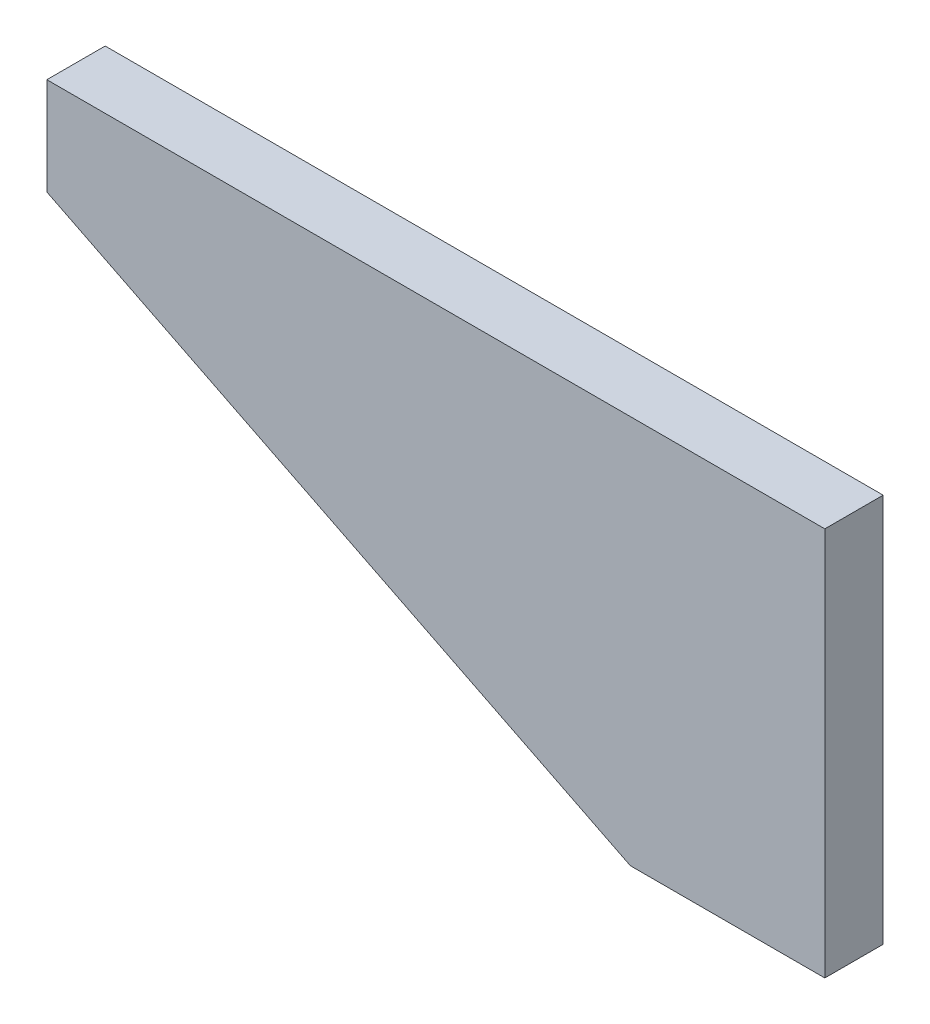
ISO-10303-21;
HEADER;
FILE_DESCRIPTION(('STEP AP214'),'2;1');
FILE_NAME('part.step','',(''),(''),'','','');
FILE_SCHEMA(('AUTOMOTIVE_DESIGN { 1 0 10303 214 1 1 1 1 }'));
ENDSEC;
DATA;
#1=APPLICATION_CONTEXT('core data for automotive mechanical design processes');
#2=APPLICATION_PROTOCOL_DEFINITION('international standard','automotive_design',2000,#1);
#3=PRODUCT_CONTEXT('',#1,'mechanical');
#4=PRODUCT('Part','Part','',(#3));
#5=PRODUCT_RELATED_PRODUCT_CATEGORY('part','',(#4));
#6=PRODUCT_DEFINITION_FORMATION('','',#4);
#7=PRODUCT_DEFINITION_CONTEXT('part definition',#1,'design');
#8=PRODUCT_DEFINITION('design','',#6,#7);
#9=PRODUCT_DEFINITION_SHAPE('','',#8);
#10=(LENGTH_UNIT() NAMED_UNIT(*) SI_UNIT(.MILLI.,.METRE.));
#11=(NAMED_UNIT(*) PLANE_ANGLE_UNIT() SI_UNIT($,.RADIAN.));
#12=(NAMED_UNIT(*) SI_UNIT($,.STERADIAN.) SOLID_ANGLE_UNIT());
#13=UNCERTAINTY_MEASURE_WITH_UNIT(LENGTH_MEASURE(1.E-05),#10,'distance_accuracy_value','');
#14=(GEOMETRIC_REPRESENTATION_CONTEXT(3) GLOBAL_UNCERTAINTY_ASSIGNED_CONTEXT((#13)) GLOBAL_UNIT_ASSIGNED_CONTEXT((#10,
#11,#12)) REPRESENTATION_CONTEXT('',''));
#15=CARTESIAN_POINT('',(0.,0.,0.));
#16=DIRECTION('',(0.,0.,1.));
#17=DIRECTION('',(1.,0.,0.));
#18=AXIS2_PLACEMENT_3D('',#15,#16,#17);
#19=CARTESIAN_POINT('',(0.,0.,15.));
#20=DIRECTION('',(0.,0.,1.));
#21=DIRECTION('',(1.,0.,0.));
#22=AXIS2_PLACEMENT_3D('',#19,#20,#21);
#23=PLANE('',#22);
#24=DIRECTION('',(1.,0.,0.));
#25=VECTOR('',#24,1.);
#26=CARTESIAN_POINT('',(-100.,50.,15.));
#27=LINE('',#26,#25);
#28=CARTESIAN_POINT('',(-100.,50.,15.));
#29=VERTEX_POINT('',#28);
#30=CARTESIAN_POINT('',(100.,50.,15.));
#31=VERTEX_POINT('',#30);
#32=EDGE_CURVE('E60',#29,#31,#27,.T.);
#33=ORIENTED_EDGE('',*,*,#32,.F.);
#34=DIRECTION('',(0.,1.,0.));
#35=VECTOR('',#34,1.);
#36=CARTESIAN_POINT('',(-100.,-50.,15.));
#37=LINE('',#36,#35);
#38=CARTESIAN_POINT('',(-100.,25.,15.));
#39=VERTEX_POINT('',#38);
#40=EDGE_CURVE('E87',#39,#29,#37,.T.);
#41=ORIENTED_EDGE('',*,*,#40,.F.);
#42=DIRECTION('',(0.894427190999916,-0.447213595499958,0.));
#43=VECTOR('',#42,1.);
#44=CARTESIAN_POINT('',(-25.,-12.5,15.));
#45=LINE('',#44,#43);
#46=CARTESIAN_POINT('',(50.,-50.,15.));
#47=VERTEX_POINT('',#46);
#48=EDGE_CURVE('E76',#47,#39,#45,.F.);
#49=ORIENTED_EDGE('',*,*,#48,.F.);
#50=DIRECTION('',(1.,0.,0.));
#51=VECTOR('',#50,1.);
#52=CARTESIAN_POINT('',(100.,-50.,15.));
#53=LINE('',#52,#51);
#54=CARTESIAN_POINT('',(100.,-50.,15.));
#55=VERTEX_POINT('',#54);
#56=EDGE_CURVE('E20',#55,#47,#53,.F.);
#57=ORIENTED_EDGE('',*,*,#56,.F.);
#58=DIRECTION('',(0.,1.,0.));
#59=VECTOR('',#58,1.);
#60=CARTESIAN_POINT('',(100.,50.,15.));
#61=LINE('',#60,#59);
#62=EDGE_CURVE('E65',#31,#55,#61,.F.);
#63=ORIENTED_EDGE('',*,*,#62,.F.);
#64=EDGE_LOOP('',(#33,#41,#49,#57,#63));
#65=FACE_BOUND('',#64,.T.);
#66=ADVANCED_FACE('F17',(#65),#23,.T.);
#67=CARTESIAN_POINT('',(100.,-50.,0.));
#68=DIRECTION('',(0.,-1.,0.));
#69=DIRECTION('',(0.,0.,-1.));
#70=AXIS2_PLACEMENT_3D('',#67,#68,#69);
#71=PLANE('',#70);
#72=DIRECTION('',(0.,0.,-1.));
#73=VECTOR('',#72,1.);
#74=CARTESIAN_POINT('',(100.,-50.,0.));
#75=LINE('',#74,#73);
#76=CARTESIAN_POINT('',(100.,-50.,0.));
#77=VERTEX_POINT('',#76);
#78=EDGE_CURVE('E70',#55,#77,#75,.T.);
#79=ORIENTED_EDGE('',*,*,#78,.F.);
#80=ORIENTED_EDGE('',*,*,#56,.T.);
#81=DIRECTION('',(0.,0.,1.));
#82=VECTOR('',#81,1.);
#83=CARTESIAN_POINT('',(50.,-50.,0.));
#84=LINE('',#83,#82);
#85=CARTESIAN_POINT('',(50.,-50.,0.));
#86=VERTEX_POINT('',#85);
#87=EDGE_CURVE('E93',#86,#47,#84,.T.);
#88=ORIENTED_EDGE('',*,*,#87,.F.);
#89=DIRECTION('',(1.,0.,0.));
#90=VECTOR('',#89,1.);
#91=CARTESIAN_POINT('',(0.,-50.,0.));
#92=LINE('',#91,#90);
#93=EDGE_CURVE('E82',#86,#77,#92,.T.);
#94=ORIENTED_EDGE('',*,*,#93,.T.);
#95=EDGE_LOOP('',(#79,#80,#88,#94));
#96=FACE_BOUND('',#95,.T.);
#97=ADVANCED_FACE('F81',(#96),#71,.T.);
#98=CARTESIAN_POINT('',(100.,50.,0.));
#99=DIRECTION('',(1.,0.,0.));
#100=DIRECTION('',(0.,0.,-1.));
#101=AXIS2_PLACEMENT_3D('',#98,#99,#100);
#102=PLANE('',#101);
#103=DIRECTION('',(0.,1.,0.));
#104=VECTOR('',#103,1.);
#105=CARTESIAN_POINT('',(100.,0.,0.));
#106=LINE('',#105,#104);
#107=CARTESIAN_POINT('',(100.,50.,0.));
#108=VERTEX_POINT('',#107);
#109=EDGE_CURVE('E96',#77,#108,#106,.T.);
#110=ORIENTED_EDGE('',*,*,#109,.T.);
#111=DIRECTION('',(0.,0.,1.));
#112=VECTOR('',#111,1.);
#113=CARTESIAN_POINT('',(100.,50.,0.));
#114=LINE('',#113,#112);
#115=EDGE_CURVE('E72',#31,#108,#114,.F.);
#116=ORIENTED_EDGE('',*,*,#115,.F.);
#117=ORIENTED_EDGE('',*,*,#62,.T.);
#118=ORIENTED_EDGE('',*,*,#78,.T.);
#119=EDGE_LOOP('',(#110,#116,#117,#118));
#120=FACE_BOUND('',#119,.T.);
#121=ADVANCED_FACE('F68',(#120),#102,.T.);
#122=CARTESIAN_POINT('',(-100.,50.,0.));
#123=DIRECTION('',(0.,1.,0.));
#124=DIRECTION('',(0.,0.,1.));
#125=AXIS2_PLACEMENT_3D('',#122,#123,#124);
#126=PLANE('',#125);
#127=DIRECTION('',(1.,0.,0.));
#128=VECTOR('',#127,1.);
#129=CARTESIAN_POINT('',(0.,50.,0.));
#130=LINE('',#129,#128);
#131=CARTESIAN_POINT('',(-100.,50.,0.));
#132=VERTEX_POINT('',#131);
#133=EDGE_CURVE('E98',#108,#132,#130,.F.);
#134=ORIENTED_EDGE('',*,*,#133,.T.);
#135=DIRECTION('',(0.,0.,1.));
#136=VECTOR('',#135,1.);
#137=CARTESIAN_POINT('',(-100.,50.,0.));
#138=LINE('',#137,#136);
#139=EDGE_CURVE('E89',#29,#132,#138,.F.);
#140=ORIENTED_EDGE('',*,*,#139,.F.);
#141=ORIENTED_EDGE('',*,*,#32,.T.);
#142=ORIENTED_EDGE('',*,*,#115,.T.);
#143=EDGE_LOOP('',(#134,#140,#141,#142));
#144=FACE_BOUND('',#143,.T.);
#145=ADVANCED_FACE('F108',(#144),#126,.T.);
#146=CARTESIAN_POINT('',(-100.,-50.,0.));
#147=DIRECTION('',(-1.,0.,0.));
#148=DIRECTION('',(0.,0.,1.));
#149=AXIS2_PLACEMENT_3D('',#146,#147,#148);
#150=PLANE('',#149);
#151=ORIENTED_EDGE('',*,*,#139,.T.);
#152=DIRECTION('',(0.,1.,0.));
#153=VECTOR('',#152,1.);
#154=CARTESIAN_POINT('',(-100.,0.,0.));
#155=LINE('',#154,#153);
#156=CARTESIAN_POINT('',(-100.,25.,0.));
#157=VERTEX_POINT('',#156);
#158=EDGE_CURVE('E26',#132,#157,#155,.F.);
#159=ORIENTED_EDGE('',*,*,#158,.T.);
#160=DIRECTION('',(0.,0.,1.));
#161=VECTOR('',#160,1.);
#162=CARTESIAN_POINT('',(-100.,25.,0.));
#163=LINE('',#162,#161);
#164=EDGE_CURVE('E34',#39,#157,#163,.F.);
#165=ORIENTED_EDGE('',*,*,#164,.F.);
#166=ORIENTED_EDGE('',*,*,#40,.T.);
#167=EDGE_LOOP('',(#151,#159,#165,#166));
#168=FACE_BOUND('',#167,.T.);
#169=ADVANCED_FACE('F104',(#168),#150,.T.);
#170=CARTESIAN_POINT('',(-25.,-12.5,0.));
#171=DIRECTION('',(-0.447213595499958,-0.894427190999916,0.));
#172=DIRECTION('',(0.894427190999916,-0.447213595499958,0.));
#173=AXIS2_PLACEMENT_3D('',#170,#171,#172);
#174=PLANE('',#173);
#175=DIRECTION('',(0.894427190999916,-0.447213595499958,0.));
#176=VECTOR('',#175,1.);
#177=CARTESIAN_POINT('',(-100.,25.,0.));
#178=LINE('',#177,#176);
#179=EDGE_CURVE('E11',#157,#86,#178,.T.);
#180=ORIENTED_EDGE('',*,*,#179,.T.);
#181=ORIENTED_EDGE('',*,*,#87,.T.);
#182=ORIENTED_EDGE('',*,*,#48,.T.);
#183=ORIENTED_EDGE('',*,*,#164,.T.);
#184=EDGE_LOOP('',(#180,#181,#182,#183));
#185=FACE_BOUND('',#184,.T.);
#186=ADVANCED_FACE('F116',(#185),#174,.T.);
#187=CARTESIAN_POINT('',(0.,0.,0.));
#188=DIRECTION('',(0.,0.,1.));
#189=DIRECTION('',(1.,0.,0.));
#190=AXIS2_PLACEMENT_3D('',#187,#188,#189);
#191=PLANE('',#190);
#192=ORIENTED_EDGE('',*,*,#158,.F.);
#193=ORIENTED_EDGE('',*,*,#133,.F.);
#194=ORIENTED_EDGE('',*,*,#109,.F.);
#195=ORIENTED_EDGE('',*,*,#93,.F.);
#196=ORIENTED_EDGE('',*,*,#179,.F.);
#197=EDGE_LOOP('',(#192,#193,#194,#195,#196));
#198=FACE_BOUND('',#197,.T.);
#199=ADVANCED_FACE('F107',(#198),#191,.F.);
#200=CLOSED_SHELL('',(#66,#97,#121,#145,#169,#186,#199));
#201=MANIFOLD_SOLID_BREP('B1',#200);
#202=ADVANCED_BREP_SHAPE_REPRESENTATION('',(#18,#201),#14);
#203=SHAPE_DEFINITION_REPRESENTATION(#9,#202);
ENDSEC;
END-ISO-10303-21;
